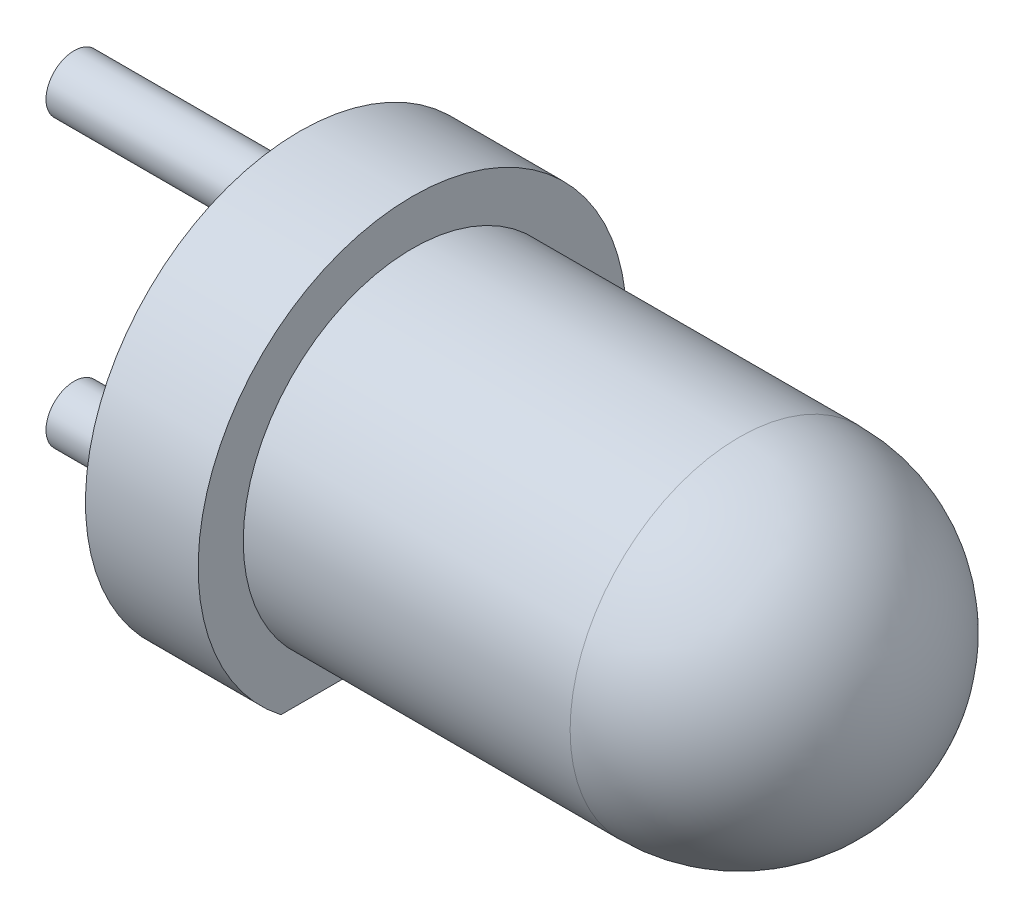
ISO-10303-21;
HEADER;
FILE_DESCRIPTION(('STEP AP214'),'2;1');
FILE_NAME('part.step','',(''),(''),'','','');
FILE_SCHEMA(('AUTOMOTIVE_DESIGN { 1 0 10303 214 1 1 1 1 }'));
ENDSEC;
DATA;
#1=APPLICATION_CONTEXT('core data for automotive mechanical design processes');
#2=APPLICATION_PROTOCOL_DEFINITION('international standard','automotive_design',2000,#1);
#3=PRODUCT_CONTEXT('',#1,'mechanical');
#4=PRODUCT('Part','Part','',(#3));
#5=PRODUCT_RELATED_PRODUCT_CATEGORY('part','',(#4));
#6=PRODUCT_DEFINITION_FORMATION('','',#4);
#7=PRODUCT_DEFINITION_CONTEXT('part definition',#1,'design');
#8=PRODUCT_DEFINITION('design','',#6,#7);
#9=PRODUCT_DEFINITION_SHAPE('','',#8);
#10=(LENGTH_UNIT() NAMED_UNIT(*) SI_UNIT(.MILLI.,.METRE.));
#11=(NAMED_UNIT(*) PLANE_ANGLE_UNIT() SI_UNIT($,.RADIAN.));
#12=(NAMED_UNIT(*) SI_UNIT($,.STERADIAN.) SOLID_ANGLE_UNIT());
#13=UNCERTAINTY_MEASURE_WITH_UNIT(LENGTH_MEASURE(1.E-05),#10,'distance_accuracy_value','');
#14=(GEOMETRIC_REPRESENTATION_CONTEXT(3) GLOBAL_UNCERTAINTY_ASSIGNED_CONTEXT((#13)) GLOBAL_UNIT_ASSIGNED_CONTEXT((#10,
#11,#12)) REPRESENTATION_CONTEXT('',''));
#15=CARTESIAN_POINT('',(0.,0.,0.));
#16=DIRECTION('',(0.,0.,1.));
#17=DIRECTION('',(1.,0.,0.));
#18=AXIS2_PLACEMENT_3D('',#15,#16,#17);
#19=CARTESIAN_POINT('',(-1.,0.,0.));
#20=DIRECTION('',(1.,0.,0.));
#21=DIRECTION('',(0.,0.,-1.));
#22=AXIS2_PLACEMENT_3D('',#19,#20,#21);
#23=PLANE('',#22);
#24=CARTESIAN_POINT('',(-1.,1.27,0.));
#25=DIRECTION('',(1.,0.,0.));
#26=DIRECTION('',(0.,0.,-1.));
#27=AXIS2_PLACEMENT_3D('',#24,#25,#26);
#28=CIRCLE('',#27,0.25);
#29=CARTESIAN_POINT('',(-1.,1.27,-0.25));
#30=VERTEX_POINT('',#29);
#31=EDGE_CURVE('E102',#30,#30,#28,.F.);
#32=ORIENTED_EDGE('',*,*,#31,.F.);
#33=EDGE_LOOP('',(#32));
#34=FACE_BOUND('',#33,.T.);
#35=CARTESIAN_POINT('',(-1.,0.,0.));
#36=DIRECTION('',(-1.,0.,0.));
#37=DIRECTION('',(0.,0.,1.));
#38=AXIS2_PLACEMENT_3D('',#35,#36,#37);
#39=CIRCLE('',#38,1.9);
#40=CARTESIAN_POINT('',(-1.,-1.5,1.16619037896906));
#41=VERTEX_POINT('',#40);
#42=CARTESIAN_POINT('',(-1.,-1.5,-1.16619037896906));
#43=VERTEX_POINT('',#42);
#44=EDGE_CURVE('E79',#41,#43,#39,.T.);
#45=ORIENTED_EDGE('',*,*,#44,.T.);
#46=DIRECTION('',(0.,0.,-1.));
#47=VECTOR('',#46,1.);
#48=CARTESIAN_POINT('',(-1.,-1.5,-1.86706033764857));
#49=LINE('',#48,#47);
#50=CARTESIAN_POINT('',(-1.,-1.5,-0.0979795897113272));
#51=VERTEX_POINT('',#50);
#52=EDGE_CURVE('E85',#51,#43,#49,.T.);
#53=ORIENTED_EDGE('',*,*,#52,.F.);
#54=CARTESIAN_POINT('',(-1.,-1.27,0.));
#55=DIRECTION('',(1.,0.,0.));
#56=DIRECTION('',(0.,0.,-1.));
#57=AXIS2_PLACEMENT_3D('',#54,#55,#56);
#58=CIRCLE('',#57,0.25);
#59=CARTESIAN_POINT('',(-1.,-1.5,0.0979795897113272));
#60=VERTEX_POINT('',#59);
#61=EDGE_CURVE('E81',#60,#51,#58,.F.);
#62=ORIENTED_EDGE('',*,*,#61,.F.);
#63=EDGE_CURVE('E48',#41,#60,#49,.T.);
#64=ORIENTED_EDGE('',*,*,#63,.F.);
#65=EDGE_LOOP('',(#45,#53,#62,#64));
#66=FACE_BOUND('',#65,.T.);
#67=ADVANCED_FACE('F34',(#34,#66),#23,.F.);
#68=CARTESIAN_POINT('',(2.9,0.,0.));
#69=DIRECTION('',(-1.,0.,0.));
#70=DIRECTION('',(0.,1.,0.));
#71=AXIS2_PLACEMENT_3D('',#68,#69,#70);
#72=SPHERICAL_SURFACE('',#71,1.5);
#73=CARTESIAN_POINT('',(2.9,0.,0.));
#74=DIRECTION('',(-1.,0.,0.));
#75=DIRECTION('',(0.,0.,1.));
#76=AXIS2_PLACEMENT_3D('',#73,#74,#75);
#77=CIRCLE('',#76,1.5);
#78=CARTESIAN_POINT('',(2.9,0.,1.5));
#79=VERTEX_POINT('',#78);
#80=EDGE_CURVE('E99',#79,#79,#77,.T.);
#81=ORIENTED_EDGE('',*,*,#80,.F.);
#82=EDGE_LOOP('',(#81));
#83=FACE_BOUND('',#82,.T.);
#84=ADVANCED_FACE('F123',(#83),#72,.T.);
#85=CARTESIAN_POINT('',(0.,0.,0.));
#86=DIRECTION('',(-1.,0.,0.));
#87=DIRECTION('',(0.,0.,1.));
#88=AXIS2_PLACEMENT_3D('',#85,#86,#87);
#89=CYLINDRICAL_SURFACE('',#88,1.5);
#90=CARTESIAN_POINT('',(0.,0.,0.));
#91=DIRECTION('',(-1.,0.,0.));
#92=DIRECTION('',(0.,0.,1.));
#93=AXIS2_PLACEMENT_3D('',#90,#91,#92);
#94=CIRCLE('',#93,1.5);
#95=CARTESIAN_POINT('',(0.,-1.5,0.));
#96=VERTEX_POINT('',#95);
#97=EDGE_CURVE('E90',#96,#96,#94,.T.);
#98=ORIENTED_EDGE('',*,*,#97,.F.);
#99=EDGE_LOOP('',(#98));
#100=FACE_BOUND('',#99,.T.);
#101=ORIENTED_EDGE('',*,*,#80,.T.);
#102=EDGE_LOOP('',(#101));
#103=FACE_BOUND('',#102,.T.);
#104=ADVANCED_FACE('F128',(#100,#103),#89,.T.);
#105=CARTESIAN_POINT('',(0.,1.5,0.));
#106=DIRECTION('',(-1.,0.,0.));
#107=DIRECTION('',(0.,0.,1.));
#108=AXIS2_PLACEMENT_3D('',#105,#106,#107);
#109=PLANE('',#108);
#110=CARTESIAN_POINT('',(0.,0.,0.));
#111=DIRECTION('',(-1.,0.,0.));
#112=DIRECTION('',(0.,0.,1.));
#113=AXIS2_PLACEMENT_3D('',#110,#111,#112);
#114=CIRCLE('',#113,1.9);
#115=CARTESIAN_POINT('',(0.,-1.5,1.16619037896906));
#116=VERTEX_POINT('',#115);
#117=CARTESIAN_POINT('',(0.,-1.5,-1.16619037896906));
#118=VERTEX_POINT('',#117);
#119=EDGE_CURVE('E87',#116,#118,#114,.T.);
#120=ORIENTED_EDGE('',*,*,#119,.F.);
#121=DIRECTION('',(0.,0.,-1.));
#122=VECTOR('',#121,1.);
#123=CARTESIAN_POINT('',(0.,-1.5,0.));
#124=LINE('',#123,#122);
#125=EDGE_CURVE('E69',#116,#96,#124,.T.);
#126=ORIENTED_EDGE('',*,*,#125,.T.);
#127=ORIENTED_EDGE('',*,*,#97,.T.);
#128=EDGE_CURVE('E152',#96,#118,#124,.T.);
#129=ORIENTED_EDGE('',*,*,#128,.T.);
#130=EDGE_LOOP('',(#120,#126,#127,#129));
#131=FACE_BOUND('',#130,.T.);
#132=ADVANCED_FACE('F138',(#131),#109,.F.);
#133=CARTESIAN_POINT('',(0.,0.,0.));
#134=DIRECTION('',(-1.,0.,0.));
#135=DIRECTION('',(0.,0.,1.));
#136=AXIS2_PLACEMENT_3D('',#133,#134,#135);
#137=CYLINDRICAL_SURFACE('',#136,1.9);
#138=ORIENTED_EDGE('',*,*,#119,.T.);
#139=DIRECTION('',(-1.,0.,0.));
#140=VECTOR('',#139,1.);
#141=CARTESIAN_POINT('',(0.,-1.5,-1.16619037896906));
#142=LINE('',#141,#140);
#143=EDGE_CURVE('E11',#118,#43,#142,.T.);
#144=ORIENTED_EDGE('',*,*,#143,.T.);
#145=ORIENTED_EDGE('',*,*,#44,.F.);
#146=DIRECTION('',(-1.,0.,0.));
#147=VECTOR('',#146,1.);
#148=CARTESIAN_POINT('',(0.,-1.5,1.16619037896906));
#149=LINE('',#148,#147);
#150=EDGE_CURVE('E41',#41,#116,#149,.F.);
#151=ORIENTED_EDGE('',*,*,#150,.T.);
#152=EDGE_LOOP('',(#138,#144,#145,#151));
#153=FACE_BOUND('',#152,.T.);
#154=ADVANCED_FACE('F86',(#153),#137,.T.);
#155=CARTESIAN_POINT('',(-3.,1.27,0.));
#156=DIRECTION('',(1.,0.,0.));
#157=DIRECTION('',(0.,0.,-1.));
#158=AXIS2_PLACEMENT_3D('',#155,#156,#157);
#159=CYLINDRICAL_SURFACE('',#158,0.25);
#160=CARTESIAN_POINT('',(-3.,1.27,0.));
#161=DIRECTION('',(-1.,0.,0.));
#162=DIRECTION('',(0.,0.,1.));
#163=AXIS2_PLACEMENT_3D('',#160,#161,#162);
#164=CIRCLE('',#163,0.25);
#165=CARTESIAN_POINT('',(-3.,1.27,0.25));
#166=VERTEX_POINT('',#165);
#167=EDGE_CURVE('E88',#166,#166,#164,.T.);
#168=ORIENTED_EDGE('',*,*,#167,.F.);
#169=EDGE_LOOP('',(#168));
#170=FACE_BOUND('',#169,.T.);
#171=ORIENTED_EDGE('',*,*,#31,.T.);
#172=EDGE_LOOP('',(#171));
#173=FACE_BOUND('',#172,.T.);
#174=ADVANCED_FACE('F118',(#170,#173),#159,.T.);
#175=CARTESIAN_POINT('',(-3.,1.27,0.));
#176=DIRECTION('',(-1.,0.,0.));
#177=DIRECTION('',(0.,0.,1.));
#178=AXIS2_PLACEMENT_3D('',#175,#176,#177);
#179=PLANE('',#178);
#180=ORIENTED_EDGE('',*,*,#167,.T.);
#181=EDGE_LOOP('',(#180));
#182=FACE_BOUND('',#181,.T.);
#183=ADVANCED_FACE('F109',(#182),#179,.T.);
#184=CARTESIAN_POINT('',(-3.,-1.27,0.));
#185=DIRECTION('',(1.,0.,0.));
#186=DIRECTION('',(0.,0.,-1.));
#187=AXIS2_PLACEMENT_3D('',#184,#185,#186);
#188=CYLINDRICAL_SURFACE('',#187,0.25);
#189=CARTESIAN_POINT('',(-3.,-1.27,0.));
#190=DIRECTION('',(-1.,0.,0.));
#191=DIRECTION('',(0.,0.,1.));
#192=AXIS2_PLACEMENT_3D('',#189,#190,#191);
#193=CIRCLE('',#192,0.25);
#194=CARTESIAN_POINT('',(-3.,-1.27,0.25));
#195=VERTEX_POINT('',#194);
#196=EDGE_CURVE('E93',#195,#195,#193,.T.);
#197=ORIENTED_EDGE('',*,*,#196,.F.);
#198=EDGE_LOOP('',(#197));
#199=FACE_BOUND('',#198,.T.);
#200=EDGE_CURVE('E74',#51,#60,#58,.F.);
#201=ORIENTED_EDGE('',*,*,#200,.T.);
#202=ORIENTED_EDGE('',*,*,#61,.T.);
#203=EDGE_LOOP('',(#201,#202));
#204=FACE_BOUND('',#203,.T.);
#205=ADVANCED_FACE('F106',(#199,#204),#188,.T.);
#206=CARTESIAN_POINT('',(-3.,-1.27,0.));
#207=DIRECTION('',(-1.,0.,0.));
#208=DIRECTION('',(0.,0.,1.));
#209=AXIS2_PLACEMENT_3D('',#206,#207,#208);
#210=PLANE('',#209);
#211=ORIENTED_EDGE('',*,*,#196,.T.);
#212=EDGE_LOOP('',(#211));
#213=FACE_BOUND('',#212,.T.);
#214=ADVANCED_FACE('F108',(#213),#210,.T.);
#215=CARTESIAN_POINT('',(3.,-1.5,-1.86706033764857));
#216=DIRECTION('',(0.,1.,0.));
#217=DIRECTION('',(0.,0.,1.));
#218=AXIS2_PLACEMENT_3D('',#215,#216,#217);
#219=PLANE('',#218);
#220=ORIENTED_EDGE('',*,*,#125,.F.);
#221=ORIENTED_EDGE('',*,*,#150,.F.);
#222=ORIENTED_EDGE('',*,*,#63,.T.);
#223=EDGE_CURVE('E83',#60,#51,#49,.T.);
#224=ORIENTED_EDGE('',*,*,#223,.T.);
#225=ORIENTED_EDGE('',*,*,#52,.T.);
#226=ORIENTED_EDGE('',*,*,#143,.F.);
#227=ORIENTED_EDGE('',*,*,#128,.F.);
#228=EDGE_LOOP('',(#220,#221,#222,#224,#225,#226,#227));
#229=FACE_BOUND('',#228,.T.);
#230=ADVANCED_FACE('F67',(#229),#219,.F.);
#231=CARTESIAN_POINT('',(-1.,-2.21728871728872,-1.86706033764857));
#232=DIRECTION('',(-1.,0.,0.));
#233=DIRECTION('',(0.,0.,1.));
#234=AXIS2_PLACEMENT_3D('',#231,#232,#233);
#235=PLANE('',#234);
#236=ORIENTED_EDGE('',*,*,#223,.F.);
#237=ORIENTED_EDGE('',*,*,#200,.F.);
#238=EDGE_LOOP('',(#236,#237));
#239=FACE_BOUND('',#238,.T.);
#240=ADVANCED_FACE('F156',(#239),#235,.F.);
#241=CLOSED_SHELL('',(#67,#84,#104,#132,#154,#174,#183,#205,#214,#230,#240));
#242=MANIFOLD_SOLID_BREP('B2',#241);
#243=ADVANCED_BREP_SHAPE_REPRESENTATION('',(#18,#242),#14);
#244=SHAPE_DEFINITION_REPRESENTATION(#9,#243);
ENDSEC;
END-ISO-10303-21;
